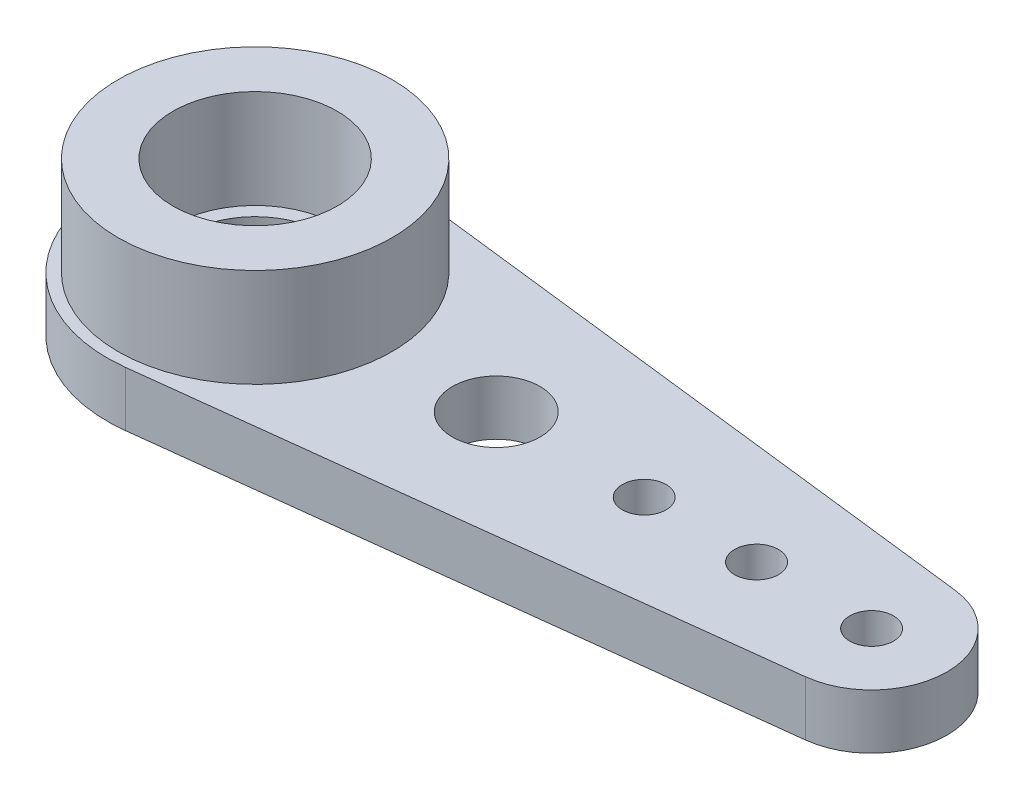
ISO-10303-21;
HEADER;
FILE_DESCRIPTION(('STEP AP214'),'2;1');
FILE_NAME('part.step','',(''),(''),'','','');
FILE_SCHEMA(('AUTOMOTIVE_DESIGN { 1 0 10303 214 1 1 1 1 }'));
ENDSEC;
DATA;
#1=APPLICATION_CONTEXT('core data for automotive mechanical design processes');
#2=APPLICATION_PROTOCOL_DEFINITION('international standard','automotive_design',2000,#1);
#3=PRODUCT_CONTEXT('',#1,'mechanical');
#4=PRODUCT('Part','Part','',(#3));
#5=PRODUCT_RELATED_PRODUCT_CATEGORY('part','',(#4));
#6=PRODUCT_DEFINITION_FORMATION('','',#4);
#7=PRODUCT_DEFINITION_CONTEXT('part definition',#1,'design');
#8=PRODUCT_DEFINITION('design','',#6,#7);
#9=PRODUCT_DEFINITION_SHAPE('','',#8);
#10=(LENGTH_UNIT() NAMED_UNIT(*) SI_UNIT(.MILLI.,.METRE.));
#11=(NAMED_UNIT(*) PLANE_ANGLE_UNIT() SI_UNIT($,.RADIAN.));
#12=(NAMED_UNIT(*) SI_UNIT($,.STERADIAN.) SOLID_ANGLE_UNIT());
#13=UNCERTAINTY_MEASURE_WITH_UNIT(LENGTH_MEASURE(1.E-05),#10,'distance_accuracy_value','');
#14=(GEOMETRIC_REPRESENTATION_CONTEXT(3) GLOBAL_UNCERTAINTY_ASSIGNED_CONTEXT((#13)) GLOBAL_UNIT_ASSIGNED_CONTEXT((#10,
#11,#12)) REPRESENTATION_CONTEXT('',''));
#15=CARTESIAN_POINT('',(0.,0.,0.));
#16=DIRECTION('',(0.,0.,1.));
#17=DIRECTION('',(1.,0.,0.));
#18=AXIS2_PLACEMENT_3D('',#15,#16,#17);
#19=CARTESIAN_POINT('',(0.,2.,0.));
#20=DIRECTION('',(0.,1.,0.));
#21=DIRECTION('',(0.,0.,1.));
#22=AXIS2_PLACEMENT_3D('',#19,#20,#21);
#23=PLANE('',#22);
#24=CARTESIAN_POINT('',(18.3,2.,0.));
#25=DIRECTION('',(0.,1.,0.));
#26=DIRECTION('',(0.,0.,1.));
#27=AXIS2_PLACEMENT_3D('',#24,#25,#26);
#28=CIRCLE('',#27,0.799999999999999);
#29=CARTESIAN_POINT('',(18.3,2.,0.799999999999999));
#30=VERTEX_POINT('',#29);
#31=EDGE_CURVE('E140',#30,#30,#28,.T.);
#32=ORIENTED_EDGE('',*,*,#31,.F.);
#33=EDGE_LOOP('',(#32));
#34=FACE_BOUND('',#33,.T.);
#35=CARTESIAN_POINT('',(8.8,2.,0.));
#36=DIRECTION('',(0.,1.,0.));
#37=DIRECTION('',(0.,0.,1.));
#38=AXIS2_PLACEMENT_3D('',#35,#36,#37);
#39=CIRCLE('',#38,1.6);
#40=CARTESIAN_POINT('',(8.8,2.,1.6));
#41=VERTEX_POINT('',#40);
#42=EDGE_CURVE('E150',#41,#41,#39,.T.);
#43=ORIENTED_EDGE('',*,*,#42,.F.);
#44=EDGE_LOOP('',(#43));
#45=FACE_BOUND('',#44,.T.);
#46=CARTESIAN_POINT('',(0.,2.,0.));
#47=DIRECTION('',(0.,1.,0.));
#48=DIRECTION('',(0.,0.,1.));
#49=AXIS2_PLACEMENT_3D('',#46,#47,#48);
#50=CIRCLE('',#49,5.4);
#51=CARTESIAN_POINT('',(0.636000000000001,2.,-5.36241587346599));
#52=VERTEX_POINT('',#51);
#53=CARTESIAN_POINT('',(0.636,2.,5.36241587346599));
#54=VERTEX_POINT('',#53);
#55=EDGE_CURVE('E86',#52,#54,#50,.T.);
#56=ORIENTED_EDGE('',*,*,#55,.T.);
#57=DIRECTION('',(0.993039976567776,0.,-0.117777777777778));
#58=VECTOR('',#57,1.);
#59=CARTESIAN_POINT('',(22.8238888888889,2.,2.73085993556138));
#60=LINE('',#59,#58);
#61=CARTESIAN_POINT('',(22.8238888888889,2.,2.73085993556138));
#62=VERTEX_POINT('',#61);
#63=EDGE_CURVE('E81',#54,#62,#60,.T.);
#64=ORIENTED_EDGE('',*,*,#63,.T.);
#65=CARTESIAN_POINT('',(22.5,2.,0.));
#66=DIRECTION('',(0.,1.,0.));
#67=DIRECTION('',(0.,0.,1.));
#68=AXIS2_PLACEMENT_3D('',#65,#66,#67);
#69=CIRCLE('',#68,2.75);
#70=CARTESIAN_POINT('',(22.8238888888889,2.,-2.73085993556138));
#71=VERTEX_POINT('',#70);
#72=EDGE_CURVE('E84',#62,#71,#69,.T.);
#73=ORIENTED_EDGE('',*,*,#72,.T.);
#74=DIRECTION('',(-0.993039976567776,0.,-0.117777777777778));
#75=VECTOR('',#74,1.);
#76=CARTESIAN_POINT('',(0.636000000000001,2.,-5.36241587346599));
#77=LINE('',#76,#75);
#78=EDGE_CURVE('E50',#71,#52,#77,.T.);
#79=ORIENTED_EDGE('',*,*,#78,.T.);
#80=EDGE_LOOP('',(#56,#64,#73,#79));
#81=FACE_BOUND('',#80,.T.);
#82=CARTESIAN_POINT('',(14.2,2.,0.));
#83=DIRECTION('',(0.,1.,0.));
#84=DIRECTION('',(0.,0.,1.));
#85=AXIS2_PLACEMENT_3D('',#82,#83,#84);
#86=CIRCLE('',#85,0.800000000000001);
#87=CARTESIAN_POINT('',(14.2,2.,0.800000000000001));
#88=VERTEX_POINT('',#87);
#89=EDGE_CURVE('E145',#88,#88,#86,.T.);
#90=ORIENTED_EDGE('',*,*,#89,.F.);
#91=EDGE_LOOP('',(#90));
#92=FACE_BOUND('',#91,.T.);
#93=CARTESIAN_POINT('',(22.5,2.,0.));
#94=DIRECTION('',(0.,1.,0.));
#95=DIRECTION('',(0.,0.,1.));
#96=AXIS2_PLACEMENT_3D('',#93,#94,#95);
#97=CIRCLE('',#96,0.799999999999999);
#98=CARTESIAN_POINT('',(22.5,2.,0.799999999999999));
#99=VERTEX_POINT('',#98);
#100=EDGE_CURVE('E129',#99,#99,#97,.T.);
#101=ORIENTED_EDGE('',*,*,#100,.F.);
#102=EDGE_LOOP('',(#101));
#103=FACE_BOUND('',#102,.T.);
#104=CARTESIAN_POINT('',(0.,2.,0.));
#105=DIRECTION('',(0.,1.,0.));
#106=DIRECTION('',(0.,0.,1.));
#107=AXIS2_PLACEMENT_3D('',#104,#105,#106);
#108=CIRCLE('',#107,5.);
#109=CARTESIAN_POINT('',(0.,2.,5.));
#110=VERTEX_POINT('',#109);
#111=EDGE_CURVE('E136',#110,#110,#108,.T.);
#112=ORIENTED_EDGE('',*,*,#111,.F.);
#113=EDGE_LOOP('',(#112));
#114=FACE_BOUND('',#113,.T.);
#115=ADVANCED_FACE('F33',(#34,#45,#81,#92,#103,#114),#23,.T.);
#116=CARTESIAN_POINT('',(0.,2.,0.));
#117=DIRECTION('',(0.,1.,0.));
#118=DIRECTION('',(0.,0.,1.));
#119=AXIS2_PLACEMENT_3D('',#116,#117,#118);
#120=CIRCLE('',#119,3.);
#121=CARTESIAN_POINT('',(0.,2.,3.));
#122=VERTEX_POINT('',#121);
#123=EDGE_CURVE('E11',#122,#122,#120,.F.);
#124=ORIENTED_EDGE('',*,*,#123,.F.);
#125=EDGE_LOOP('',(#124));
#126=FACE_BOUND('',#125,.T.);
#127=CARTESIAN_POINT('',(0.,2.,0.));
#128=DIRECTION('',(0.,1.,0.));
#129=DIRECTION('',(0.,0.,1.));
#130=AXIS2_PLACEMENT_3D('',#127,#128,#129);
#131=CIRCLE('',#130,2.5);
#132=CARTESIAN_POINT('',(0.,2.,2.5));
#133=VERTEX_POINT('',#132);
#134=EDGE_CURVE('E103',#133,#133,#131,.T.);
#135=ORIENTED_EDGE('',*,*,#134,.F.);
#136=EDGE_LOOP('',(#135));
#137=FACE_BOUND('',#136,.T.);
#138=ADVANCED_FACE('F114',(#126,#137),#23,.T.);
#139=CARTESIAN_POINT('',(0.,0.,0.));
#140=DIRECTION('',(0.,1.,0.));
#141=DIRECTION('',(0.,0.,1.));
#142=AXIS2_PLACEMENT_3D('',#139,#140,#141);
#143=PLANE('',#142);
#144=CARTESIAN_POINT('',(18.3,0.,0.));
#145=DIRECTION('',(0.,1.,0.));
#146=DIRECTION('',(0.,0.,1.));
#147=AXIS2_PLACEMENT_3D('',#144,#145,#146);
#148=CIRCLE('',#147,0.799999999999999);
#149=CARTESIAN_POINT('',(18.3,0.,0.799999999999999));
#150=VERTEX_POINT('',#149);
#151=EDGE_CURVE('E133',#150,#150,#148,.T.);
#152=ORIENTED_EDGE('',*,*,#151,.T.);
#153=EDGE_LOOP('',(#152));
#154=FACE_BOUND('',#153,.T.);
#155=CARTESIAN_POINT('',(8.8,0.,0.));
#156=DIRECTION('',(0.,1.,0.));
#157=DIRECTION('',(0.,0.,1.));
#158=AXIS2_PLACEMENT_3D('',#155,#156,#157);
#159=CIRCLE('',#158,1.6);
#160=CARTESIAN_POINT('',(8.8,0.,1.6));
#161=VERTEX_POINT('',#160);
#162=EDGE_CURVE('E148',#161,#161,#159,.T.);
#163=ORIENTED_EDGE('',*,*,#162,.T.);
#164=EDGE_LOOP('',(#163));
#165=FACE_BOUND('',#164,.T.);
#166=CARTESIAN_POINT('',(0.,0.,0.));
#167=DIRECTION('',(0.,1.,0.));
#168=DIRECTION('',(0.,0.,1.));
#169=AXIS2_PLACEMENT_3D('',#166,#167,#168);
#170=CIRCLE('',#169,5.4);
#171=CARTESIAN_POINT('',(0.636000000000001,0.,-5.36241587346599));
#172=VERTEX_POINT('',#171);
#173=CARTESIAN_POINT('',(0.636,0.,5.36241587346599));
#174=VERTEX_POINT('',#173);
#175=EDGE_CURVE('E100',#172,#174,#170,.T.);
#176=ORIENTED_EDGE('',*,*,#175,.F.);
#177=DIRECTION('',(-0.993039976567776,0.,-0.117777777777778));
#178=VECTOR('',#177,1.);
#179=CARTESIAN_POINT('',(0.636000000000001,0.,-5.36241587346599));
#180=LINE('',#179,#178);
#181=CARTESIAN_POINT('',(22.8238888888889,0.,-2.73085993556138));
#182=VERTEX_POINT('',#181);
#183=EDGE_CURVE('E73',#182,#172,#180,.T.);
#184=ORIENTED_EDGE('',*,*,#183,.F.);
#185=CARTESIAN_POINT('',(22.5,0.,0.));
#186=DIRECTION('',(0.,1.,0.));
#187=DIRECTION('',(0.,0.,1.));
#188=AXIS2_PLACEMENT_3D('',#185,#186,#187);
#189=CIRCLE('',#188,2.75);
#190=CARTESIAN_POINT('',(22.8238888888889,0.,2.73085993556138));
#191=VERTEX_POINT('',#190);
#192=EDGE_CURVE('E67',#191,#182,#189,.T.);
#193=ORIENTED_EDGE('',*,*,#192,.F.);
#194=DIRECTION('',(0.993039976567776,0.,-0.117777777777778));
#195=VECTOR('',#194,1.);
#196=CARTESIAN_POINT('',(22.8238888888889,0.,2.73085993556138));
#197=LINE('',#196,#195);
#198=EDGE_CURVE('E91',#174,#191,#197,.T.);
#199=ORIENTED_EDGE('',*,*,#198,.F.);
#200=EDGE_LOOP('',(#176,#184,#193,#199));
#201=FACE_BOUND('',#200,.T.);
#202=CARTESIAN_POINT('',(0.,0.,0.));
#203=DIRECTION('',(0.,1.,0.));
#204=DIRECTION('',(0.,0.,1.));
#205=AXIS2_PLACEMENT_3D('',#202,#203,#204);
#206=CIRCLE('',#205,2.5);
#207=CARTESIAN_POINT('',(0.,0.,2.5));
#208=VERTEX_POINT('',#207);
#209=EDGE_CURVE('E120',#208,#208,#206,.T.);
#210=ORIENTED_EDGE('',*,*,#209,.T.);
#211=EDGE_LOOP('',(#210));
#212=FACE_BOUND('',#211,.T.);
#213=CARTESIAN_POINT('',(14.2,0.,0.));
#214=DIRECTION('',(0.,1.,0.));
#215=DIRECTION('',(0.,0.,1.));
#216=AXIS2_PLACEMENT_3D('',#213,#214,#215);
#217=CIRCLE('',#216,0.800000000000001);
#218=CARTESIAN_POINT('',(14.2,0.,0.800000000000001));
#219=VERTEX_POINT('',#218);
#220=EDGE_CURVE('E124',#219,#219,#217,.T.);
#221=ORIENTED_EDGE('',*,*,#220,.T.);
#222=EDGE_LOOP('',(#221));
#223=FACE_BOUND('',#222,.T.);
#224=CARTESIAN_POINT('',(22.5,0.,0.));
#225=DIRECTION('',(0.,1.,0.));
#226=DIRECTION('',(0.,0.,1.));
#227=AXIS2_PLACEMENT_3D('',#224,#225,#226);
#228=CIRCLE('',#227,0.799999999999999);
#229=CARTESIAN_POINT('',(22.5,0.,0.799999999999999));
#230=VERTEX_POINT('',#229);
#231=EDGE_CURVE('E127',#230,#230,#228,.T.);
#232=ORIENTED_EDGE('',*,*,#231,.T.);
#233=EDGE_LOOP('',(#232));
#234=FACE_BOUND('',#233,.T.);
#235=ADVANCED_FACE('F111',(#154,#165,#201,#212,#223,#234),#143,.F.);
#236=CARTESIAN_POINT('',(0.,2.,0.));
#237=DIRECTION('',(0.,-1.,0.));
#238=DIRECTION('',(0.,0.,-1.));
#239=AXIS2_PLACEMENT_3D('',#236,#237,#238);
#240=CYLINDRICAL_SURFACE('',#239,5.4);
#241=ORIENTED_EDGE('',*,*,#175,.T.);
#242=DIRECTION('',(0.,-1.,0.));
#243=VECTOR('',#242,1.);
#244=CARTESIAN_POINT('',(0.636,2.,5.36241587346599));
#245=LINE('',#244,#243);
#246=EDGE_CURVE('E42',#54,#174,#245,.T.);
#247=ORIENTED_EDGE('',*,*,#246,.F.);
#248=ORIENTED_EDGE('',*,*,#55,.F.);
#249=DIRECTION('',(0.,-1.,0.));
#250=VECTOR('',#249,1.);
#251=CARTESIAN_POINT('',(0.636000000000001,2.,-5.36241587346599));
#252=LINE('',#251,#250);
#253=EDGE_CURVE('E96',#52,#172,#252,.T.);
#254=ORIENTED_EDGE('',*,*,#253,.T.);
#255=EDGE_LOOP('',(#241,#247,#248,#254));
#256=FACE_BOUND('',#255,.T.);
#257=ADVANCED_FACE('F35',(#256),#240,.T.);
#258=CARTESIAN_POINT('',(22.8238888888889,2.,2.73085993556138));
#259=DIRECTION('',(-0.117777777777778,0.,-0.993039976567776));
#260=DIRECTION('',(-0.993039976567776,0.,0.117777777777778));
#261=AXIS2_PLACEMENT_3D('',#258,#259,#260);
#262=PLANE('',#261);
#263=ORIENTED_EDGE('',*,*,#198,.T.);
#264=DIRECTION('',(0.,-1.,0.));
#265=VECTOR('',#264,1.);
#266=CARTESIAN_POINT('',(22.8238888888889,2.,2.73085993556138));
#267=LINE('',#266,#265);
#268=EDGE_CURVE('E89',#62,#191,#267,.T.);
#269=ORIENTED_EDGE('',*,*,#268,.F.);
#270=ORIENTED_EDGE('',*,*,#63,.F.);
#271=ORIENTED_EDGE('',*,*,#246,.T.);
#272=EDGE_LOOP('',(#263,#269,#270,#271));
#273=FACE_BOUND('',#272,.T.);
#274=ADVANCED_FACE('F90',(#273),#262,.F.);
#275=CARTESIAN_POINT('',(22.5,2.,0.));
#276=DIRECTION('',(0.,-1.,0.));
#277=DIRECTION('',(0.,0.,-1.));
#278=AXIS2_PLACEMENT_3D('',#275,#276,#277);
#279=CYLINDRICAL_SURFACE('',#278,2.75);
#280=ORIENTED_EDGE('',*,*,#192,.T.);
#281=DIRECTION('',(0.,-1.,0.));
#282=VECTOR('',#281,1.);
#283=CARTESIAN_POINT('',(22.8238888888889,2.,-2.73085993556138));
#284=LINE('',#283,#282);
#285=EDGE_CURVE('E92',#71,#182,#284,.T.);
#286=ORIENTED_EDGE('',*,*,#285,.F.);
#287=ORIENTED_EDGE('',*,*,#72,.F.);
#288=ORIENTED_EDGE('',*,*,#268,.T.);
#289=EDGE_LOOP('',(#280,#286,#287,#288));
#290=FACE_BOUND('',#289,.T.);
#291=ADVANCED_FACE('F94',(#290),#279,.T.);
#292=CARTESIAN_POINT('',(0.636000000000001,2.,-5.36241587346599));
#293=DIRECTION('',(-0.117777777777778,0.,0.993039976567776));
#294=DIRECTION('',(0.993039976567776,0.,0.117777777777778));
#295=AXIS2_PLACEMENT_3D('',#292,#293,#294);
#296=PLANE('',#295);
#297=ORIENTED_EDGE('',*,*,#183,.T.);
#298=ORIENTED_EDGE('',*,*,#253,.F.);
#299=ORIENTED_EDGE('',*,*,#78,.F.);
#300=ORIENTED_EDGE('',*,*,#285,.T.);
#301=EDGE_LOOP('',(#297,#298,#299,#300));
#302=FACE_BOUND('',#301,.T.);
#303=ADVANCED_FACE('F173',(#302),#296,.F.);
#304=CARTESIAN_POINT('',(0.,2.,0.));
#305=DIRECTION('',(0.,-1.,0.));
#306=DIRECTION('',(0.,0.,-1.));
#307=AXIS2_PLACEMENT_3D('',#304,#305,#306);
#308=CYLINDRICAL_SURFACE('',#307,2.5);
#309=ORIENTED_EDGE('',*,*,#134,.T.);
#310=EDGE_LOOP('',(#309));
#311=FACE_BOUND('',#310,.T.);
#312=ORIENTED_EDGE('',*,*,#209,.F.);
#313=EDGE_LOOP('',(#312));
#314=FACE_BOUND('',#313,.T.);
#315=ADVANCED_FACE('F159',(#311,#314),#308,.F.);
#316=CARTESIAN_POINT('',(8.8,2.,0.));
#317=DIRECTION('',(0.,-1.,0.));
#318=DIRECTION('',(0.,0.,-1.));
#319=AXIS2_PLACEMENT_3D('',#316,#317,#318);
#320=CYLINDRICAL_SURFACE('',#319,1.6);
#321=ORIENTED_EDGE('',*,*,#42,.T.);
#322=EDGE_LOOP('',(#321));
#323=FACE_BOUND('',#322,.T.);
#324=ORIENTED_EDGE('',*,*,#162,.F.);
#325=EDGE_LOOP('',(#324));
#326=FACE_BOUND('',#325,.T.);
#327=ADVANCED_FACE('F216',(#323,#326),#320,.F.);
#328=CARTESIAN_POINT('',(14.2,2.,0.));
#329=DIRECTION('',(0.,-1.,0.));
#330=DIRECTION('',(0.,0.,-1.));
#331=AXIS2_PLACEMENT_3D('',#328,#329,#330);
#332=CYLINDRICAL_SURFACE('',#331,0.800000000000001);
#333=ORIENTED_EDGE('',*,*,#89,.T.);
#334=EDGE_LOOP('',(#333));
#335=FACE_BOUND('',#334,.T.);
#336=ORIENTED_EDGE('',*,*,#220,.F.);
#337=EDGE_LOOP('',(#336));
#338=FACE_BOUND('',#337,.T.);
#339=ADVANCED_FACE('F223',(#335,#338),#332,.F.);
#340=CARTESIAN_POINT('',(18.3,2.,0.));
#341=DIRECTION('',(0.,-1.,0.));
#342=DIRECTION('',(0.,0.,-1.));
#343=AXIS2_PLACEMENT_3D('',#340,#341,#342);
#344=CYLINDRICAL_SURFACE('',#343,0.799999999999999);
#345=ORIENTED_EDGE('',*,*,#31,.T.);
#346=EDGE_LOOP('',(#345));
#347=FACE_BOUND('',#346,.T.);
#348=ORIENTED_EDGE('',*,*,#151,.F.);
#349=EDGE_LOOP('',(#348));
#350=FACE_BOUND('',#349,.T.);
#351=ADVANCED_FACE('F231',(#347,#350),#344,.F.);
#352=CARTESIAN_POINT('',(22.5,2.,0.));
#353=DIRECTION('',(0.,-1.,0.));
#354=DIRECTION('',(0.,0.,-1.));
#355=AXIS2_PLACEMENT_3D('',#352,#353,#354);
#356=CYLINDRICAL_SURFACE('',#355,0.799999999999999);
#357=ORIENTED_EDGE('',*,*,#100,.T.);
#358=EDGE_LOOP('',(#357));
#359=FACE_BOUND('',#358,.T.);
#360=ORIENTED_EDGE('',*,*,#231,.F.);
#361=EDGE_LOOP('',(#360));
#362=FACE_BOUND('',#361,.T.);
#363=ADVANCED_FACE('F240',(#359,#362),#356,.F.);
#364=CARTESIAN_POINT('',(0.,5.6,0.));
#365=DIRECTION('',(0.,1.,0.));
#366=DIRECTION('',(0.,0.,1.));
#367=AXIS2_PLACEMENT_3D('',#364,#365,#366);
#368=PLANE('',#367);
#369=CARTESIAN_POINT('',(0.,5.6,0.));
#370=DIRECTION('',(0.,1.,0.));
#371=DIRECTION('',(0.,0.,1.));
#372=AXIS2_PLACEMENT_3D('',#369,#370,#371);
#373=CIRCLE('',#372,5.);
#374=CARTESIAN_POINT('',(0.,5.6,5.));
#375=VERTEX_POINT('',#374);
#376=EDGE_CURVE('E130',#375,#375,#373,.T.);
#377=ORIENTED_EDGE('',*,*,#376,.T.);
#378=EDGE_LOOP('',(#377));
#379=FACE_BOUND('',#378,.T.);
#380=CARTESIAN_POINT('',(0.,5.6,0.));
#381=DIRECTION('',(0.,1.,0.));
#382=DIRECTION('',(0.,0.,1.));
#383=AXIS2_PLACEMENT_3D('',#380,#381,#382);
#384=CIRCLE('',#383,3.);
#385=CARTESIAN_POINT('',(0.,5.6,3.));
#386=VERTEX_POINT('',#385);
#387=EDGE_CURVE('E296',#386,#386,#384,.T.);
#388=ORIENTED_EDGE('',*,*,#387,.F.);
#389=EDGE_LOOP('',(#388));
#390=FACE_BOUND('',#389,.T.);
#391=ADVANCED_FACE('F249',(#379,#390),#368,.T.);
#392=CARTESIAN_POINT('',(0.,5.6,0.));
#393=DIRECTION('',(0.,-1.,0.));
#394=DIRECTION('',(0.,0.,-1.));
#395=AXIS2_PLACEMENT_3D('',#392,#393,#394);
#396=CYLINDRICAL_SURFACE('',#395,5.);
#397=ORIENTED_EDGE('',*,*,#376,.F.);
#398=EDGE_LOOP('',(#397));
#399=FACE_BOUND('',#398,.T.);
#400=ORIENTED_EDGE('',*,*,#111,.T.);
#401=EDGE_LOOP('',(#400));
#402=FACE_BOUND('',#401,.T.);
#403=ADVANCED_FACE('F263',(#399,#402),#396,.T.);
#404=CARTESIAN_POINT('',(0.,5.6,0.));
#405=DIRECTION('',(0.,-1.,0.));
#406=DIRECTION('',(0.,0.,-1.));
#407=AXIS2_PLACEMENT_3D('',#404,#405,#406);
#408=CYLINDRICAL_SURFACE('',#407,3.);
#409=ORIENTED_EDGE('',*,*,#387,.T.);
#410=EDGE_LOOP('',(#409));
#411=FACE_BOUND('',#410,.T.);
#412=ORIENTED_EDGE('',*,*,#123,.T.);
#413=EDGE_LOOP('',(#412));
#414=FACE_BOUND('',#413,.T.);
#415=ADVANCED_FACE('F272',(#411,#414),#408,.F.);
#416=CLOSED_SHELL('',(#115,#138,#235,#257,#274,#291,#303,#315,#327,#339,#351,#363,#391,#403,#415));
#417=MANIFOLD_SOLID_BREP('B2',#416);
#418=ADVANCED_BREP_SHAPE_REPRESENTATION('',(#18,#417),#14);
#419=SHAPE_DEFINITION_REPRESENTATION(#9,#418);
ENDSEC;
END-ISO-10303-21;
